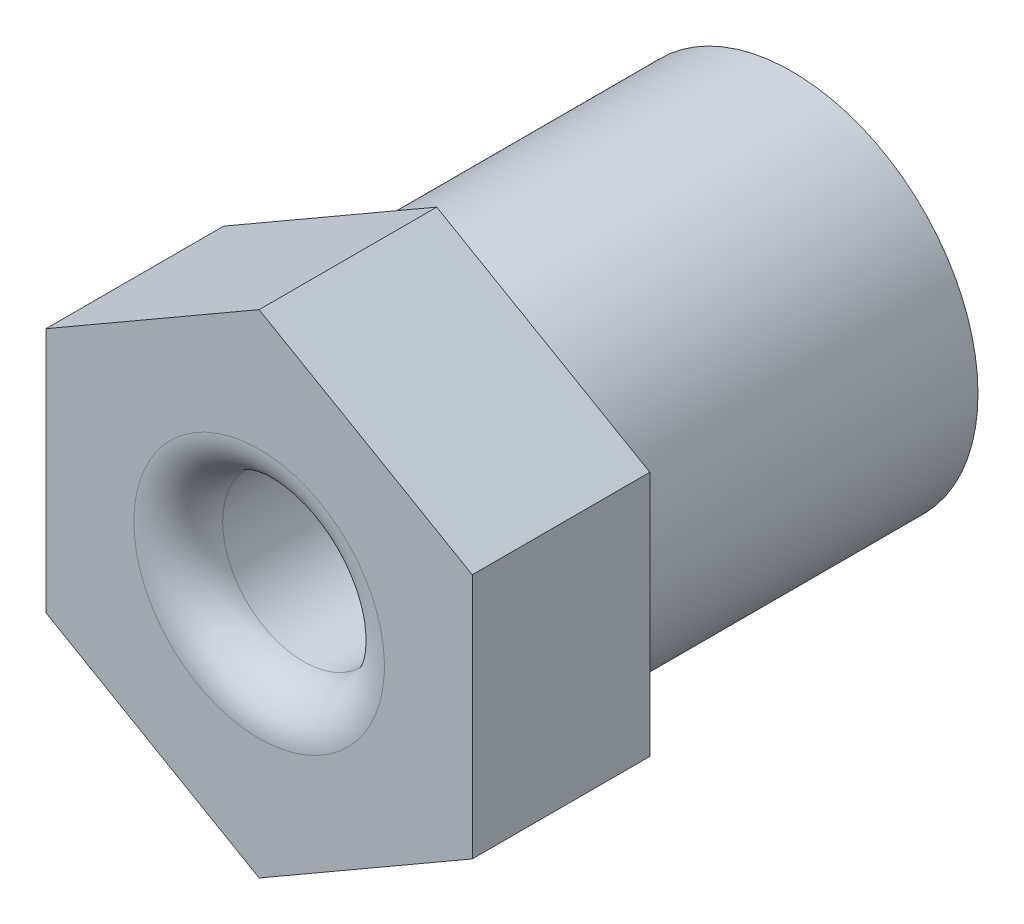
ISO-10303-21;
HEADER;
FILE_DESCRIPTION(('STEP AP214'),'2;1');
FILE_NAME('part.step','',(''),(''),'','','');
FILE_SCHEMA(('AUTOMOTIVE_DESIGN { 1 0 10303 214 1 1 1 1 }'));
ENDSEC;
DATA;
#1=APPLICATION_CONTEXT('core data for automotive mechanical design processes');
#2=APPLICATION_PROTOCOL_DEFINITION('international standard','automotive_design',2000,#1);
#3=PRODUCT_CONTEXT('',#1,'mechanical');
#4=PRODUCT('Part','Part','',(#3));
#5=PRODUCT_RELATED_PRODUCT_CATEGORY('part','',(#4));
#6=PRODUCT_DEFINITION_FORMATION('','',#4);
#7=PRODUCT_DEFINITION_CONTEXT('part definition',#1,'design');
#8=PRODUCT_DEFINITION('design','',#6,#7);
#9=PRODUCT_DEFINITION_SHAPE('','',#8);
#10=(LENGTH_UNIT() NAMED_UNIT(*) SI_UNIT(.MILLI.,.METRE.));
#11=(NAMED_UNIT(*) PLANE_ANGLE_UNIT() SI_UNIT($,.RADIAN.));
#12=(NAMED_UNIT(*) SI_UNIT($,.STERADIAN.) SOLID_ANGLE_UNIT());
#13=UNCERTAINTY_MEASURE_WITH_UNIT(LENGTH_MEASURE(1.E-05),#10,'distance_accuracy_value','');
#14=(GEOMETRIC_REPRESENTATION_CONTEXT(3) GLOBAL_UNCERTAINTY_ASSIGNED_CONTEXT((#13)) GLOBAL_UNIT_ASSIGNED_CONTEXT((#10,
#11,#12)) REPRESENTATION_CONTEXT('',''));
#15=CARTESIAN_POINT('',(0.,0.,0.));
#16=DIRECTION('',(0.,0.,1.));
#17=DIRECTION('',(1.,0.,0.));
#18=AXIS2_PLACEMENT_3D('',#15,#16,#17);
#19=CARTESIAN_POINT('',(-3.65791116486798,3.45094953686021,0.));
#20=DIRECTION('',(0.,0.,1.));
#21=DIRECTION('',(1.,0.,0.));
#22=AXIS2_PLACEMENT_3D('',#19,#20,#21);
#23=PLANE('',#22);
#24=CARTESIAN_POINT('',(-3.65791116486798,3.45094953686021,0.));
#25=DIRECTION('',(0.,0.,1.));
#26=DIRECTION('',(-1.,0.,0.));
#27=AXIS2_PLACEMENT_3D('',#24,#25,#26);
#28=CIRCLE('',#27,0.91087);
#29=CARTESIAN_POINT('',(-4.56878116486798,3.45094953686021,0.));
#30=VERTEX_POINT('',#29);
#31=EDGE_CURVE('E126',#30,#30,#28,.T.);
#32=ORIENTED_EDGE('',*,*,#31,.T.);
#33=EDGE_LOOP('',(#32));
#34=FACE_BOUND('',#33,.T.);
#35=CARTESIAN_POINT('',(-3.65791116486798,3.45094953686021,0.));
#36=DIRECTION('',(0.,0.,-1.));
#37=DIRECTION('',(1.,0.,0.));
#38=AXIS2_PLACEMENT_3D('',#35,#36,#37);
#39=CIRCLE('',#38,1.6);
#40=CARTESIAN_POINT('',(-2.05791116486798,3.45094953686021,0.));
#41=VERTEX_POINT('',#40);
#42=EDGE_CURVE('E166',#41,#41,#39,.T.);
#43=ORIENTED_EDGE('',*,*,#42,.T.);
#44=EDGE_LOOP('',(#43));
#45=FACE_BOUND('',#44,.T.);
#46=ADVANCED_FACE('F17',(#34,#45),#23,.F.);
#47=CARTESIAN_POINT('',(-1.25791116486653,4.83659053686006,0.));
#48=DIRECTION('',(1.,0.,0.));
#49=DIRECTION('',(0.,1.,0.));
#50=AXIS2_PLACEMENT_3D('',#47,#48,#49);
#51=PLANE('',#50);
#52=DIRECTION('',(0.,-1.,0.));
#53=VECTOR('',#52,1.);
#54=CARTESIAN_POINT('',(-1.25791116486653,4.83659053686006,2.));
#55=LINE('',#54,#53);
#56=CARTESIAN_POINT('',(-1.25791116486653,4.83659053686006,2.));
#57=VERTEX_POINT('',#56);
#58=CARTESIAN_POINT('',(-1.25791116486653,2.06530853686036,2.));
#59=VERTEX_POINT('',#58);
#60=EDGE_CURVE('E132',#57,#59,#55,.T.);
#61=ORIENTED_EDGE('',*,*,#60,.T.);
#62=DIRECTION('',(0.,0.,1.));
#63=VECTOR('',#62,1.);
#64=CARTESIAN_POINT('',(-1.25791116486653,2.06530853686036,0.));
#65=LINE('',#64,#63);
#66=CARTESIAN_POINT('',(-1.25791116486653,2.06530853686036,0.));
#67=VERTEX_POINT('',#66);
#68=EDGE_CURVE('E144',#67,#59,#65,.T.);
#69=ORIENTED_EDGE('',*,*,#68,.F.);
#70=DIRECTION('',(0.,-1.,0.));
#71=VECTOR('',#70,1.);
#72=CARTESIAN_POINT('',(-1.25791116486653,4.83659053686006,0.));
#73=LINE('',#72,#71);
#74=CARTESIAN_POINT('',(-1.25791116486653,4.83659053686006,0.));
#75=VERTEX_POINT('',#74);
#76=EDGE_CURVE('E175',#75,#67,#73,.T.);
#77=ORIENTED_EDGE('',*,*,#76,.F.);
#78=DIRECTION('',(0.,0.,1.));
#79=VECTOR('',#78,1.);
#80=CARTESIAN_POINT('',(-1.25791116486653,4.83659053686006,0.));
#81=LINE('',#80,#79);
#82=EDGE_CURVE('E11',#75,#57,#81,.T.);
#83=ORIENTED_EDGE('',*,*,#82,.T.);
#84=EDGE_LOOP('',(#61,#69,#77,#83));
#85=FACE_BOUND('',#84,.T.);
#86=ADVANCED_FACE('F211',(#85),#51,.T.);
#87=CARTESIAN_POINT('',(-3.65791116486798,6.22223053686048,0.));
#88=DIRECTION('',(0.499999825156066,0.866025504730608,0.));
#89=DIRECTION('',(0.,0.,-1.));
#90=AXIS2_PLACEMENT_3D('',#87,#88,#89);
#91=PLANE('',#90);
#92=DIRECTION('',(0.866025504730608,-0.499999825156065,0.));
#93=VECTOR('',#92,1.);
#94=CARTESIAN_POINT('',(-3.65791116486798,6.22223053686048,2.));
#95=LINE('',#94,#93);
#96=CARTESIAN_POINT('',(-3.65791116486798,6.22223053686048,2.));
#97=VERTEX_POINT('',#96);
#98=EDGE_CURVE('E136',#97,#57,#95,.T.);
#99=ORIENTED_EDGE('',*,*,#98,.T.);
#100=ORIENTED_EDGE('',*,*,#82,.F.);
#101=DIRECTION('',(0.866025504730608,-0.499999825156065,0.));
#102=VECTOR('',#101,1.);
#103=CARTESIAN_POINT('',(-3.65791116486798,6.22223053686048,0.));
#104=LINE('',#103,#102);
#105=CARTESIAN_POINT('',(-3.65791116486798,6.22223053686048,0.));
#106=VERTEX_POINT('',#105);
#107=EDGE_CURVE('E102',#106,#75,#104,.T.);
#108=ORIENTED_EDGE('',*,*,#107,.F.);
#109=DIRECTION('',(0.,0.,1.));
#110=VECTOR('',#109,1.);
#111=CARTESIAN_POINT('',(-3.65791116486798,6.22223053686048,0.));
#112=LINE('',#111,#110);
#113=EDGE_CURVE('E26',#106,#97,#112,.T.);
#114=ORIENTED_EDGE('',*,*,#113,.T.);
#115=EDGE_LOOP('',(#99,#100,#108,#114));
#116=FACE_BOUND('',#115,.T.);
#117=ADVANCED_FACE('F19',(#116),#91,.T.);
#118=CARTESIAN_POINT('',(-6.05791116486944,4.83659053686006,0.));
#119=DIRECTION('',(-0.499999825156066,0.866025504730608,0.));
#120=DIRECTION('',(0.,0.,1.));
#121=AXIS2_PLACEMENT_3D('',#118,#119,#120);
#122=PLANE('',#121);
#123=DIRECTION('',(0.866025504730608,0.499999825156065,0.));
#124=VECTOR('',#123,1.);
#125=CARTESIAN_POINT('',(-6.05791116486944,4.83659053686006,2.));
#126=LINE('',#125,#124);
#127=CARTESIAN_POINT('',(-6.05791116486944,4.83659053686006,2.));
#128=VERTEX_POINT('',#127);
#129=EDGE_CURVE('E137',#128,#97,#126,.T.);
#130=ORIENTED_EDGE('',*,*,#129,.T.);
#131=ORIENTED_EDGE('',*,*,#113,.F.);
#132=DIRECTION('',(0.866025504730608,0.499999825156065,0.));
#133=VECTOR('',#132,1.);
#134=CARTESIAN_POINT('',(-6.05791116486944,4.83659053686006,0.));
#135=LINE('',#134,#133);
#136=CARTESIAN_POINT('',(-6.05791116486944,4.83659053686006,0.));
#137=VERTEX_POINT('',#136);
#138=EDGE_CURVE('E96',#137,#106,#135,.T.);
#139=ORIENTED_EDGE('',*,*,#138,.F.);
#140=DIRECTION('',(0.,0.,1.));
#141=VECTOR('',#140,1.);
#142=CARTESIAN_POINT('',(-6.05791116486944,4.83659053686006,0.));
#143=LINE('',#142,#141);
#144=EDGE_CURVE('E48',#137,#128,#143,.T.);
#145=ORIENTED_EDGE('',*,*,#144,.T.);
#146=EDGE_LOOP('',(#130,#131,#139,#145));
#147=FACE_BOUND('',#146,.T.);
#148=ADVANCED_FACE('F97',(#147),#122,.T.);
#149=CARTESIAN_POINT('',(-6.05791116486944,2.06530853686036,0.));
#150=DIRECTION('',(-1.,0.,0.));
#151=DIRECTION('',(0.,0.,1.));
#152=AXIS2_PLACEMENT_3D('',#149,#150,#151);
#153=PLANE('',#152);
#154=DIRECTION('',(0.,1.,0.));
#155=VECTOR('',#154,1.);
#156=CARTESIAN_POINT('',(-6.05791116486944,2.06530853686036,2.));
#157=LINE('',#156,#155);
#158=CARTESIAN_POINT('',(-6.05791116486944,2.06530853686036,2.));
#159=VERTEX_POINT('',#158);
#160=EDGE_CURVE('E91',#159,#128,#157,.T.);
#161=ORIENTED_EDGE('',*,*,#160,.T.);
#162=ORIENTED_EDGE('',*,*,#144,.F.);
#163=DIRECTION('',(0.,1.,0.));
#164=VECTOR('',#163,1.);
#165=CARTESIAN_POINT('',(-6.05791116486944,2.06530853686036,0.));
#166=LINE('',#165,#164);
#167=CARTESIAN_POINT('',(-6.05791116486944,2.06530853686036,0.));
#168=VERTEX_POINT('',#167);
#169=EDGE_CURVE('E88',#168,#137,#166,.T.);
#170=ORIENTED_EDGE('',*,*,#169,.F.);
#171=DIRECTION('',(0.,0.,1.));
#172=VECTOR('',#171,1.);
#173=CARTESIAN_POINT('',(-6.05791116486944,2.06530853686036,0.));
#174=LINE('',#173,#172);
#175=EDGE_CURVE('E38',#168,#159,#174,.T.);
#176=ORIENTED_EDGE('',*,*,#175,.T.);
#177=EDGE_LOOP('',(#161,#162,#170,#176));
#178=FACE_BOUND('',#177,.T.);
#179=ADVANCED_FACE('F86',(#178),#153,.T.);
#180=CARTESIAN_POINT('',(-3.65791116486798,0.679668536859936,0.));
#181=DIRECTION('',(-0.499999825156065,-0.866025504730608,0.));
#182=DIRECTION('',(-0.866025504730608,0.499999825156065,0.));
#183=AXIS2_PLACEMENT_3D('',#180,#181,#182);
#184=PLANE('',#183);
#185=DIRECTION('',(-0.866025504730608,0.499999825156065,0.));
#186=VECTOR('',#185,1.);
#187=CARTESIAN_POINT('',(-3.65791116486798,0.679668536859936,2.));
#188=LINE('',#187,#186);
#189=CARTESIAN_POINT('',(-3.65791116486798,0.679668536859936,2.));
#190=VERTEX_POINT('',#189);
#191=EDGE_CURVE('E122',#190,#159,#188,.T.);
#192=ORIENTED_EDGE('',*,*,#191,.T.);
#193=ORIENTED_EDGE('',*,*,#175,.F.);
#194=DIRECTION('',(-0.866025504730608,0.499999825156065,0.));
#195=VECTOR('',#194,1.);
#196=CARTESIAN_POINT('',(-3.65791116486798,0.679668536859936,0.));
#197=LINE('',#196,#195);
#198=CARTESIAN_POINT('',(-3.65791116486798,0.679668536859936,0.));
#199=VERTEX_POINT('',#198);
#200=EDGE_CURVE('E108',#199,#168,#197,.T.);
#201=ORIENTED_EDGE('',*,*,#200,.F.);
#202=DIRECTION('',(0.,0.,1.));
#203=VECTOR('',#202,1.);
#204=CARTESIAN_POINT('',(-3.65791116486798,0.679668536859936,0.));
#205=LINE('',#204,#203);
#206=EDGE_CURVE('E125',#199,#190,#205,.T.);
#207=ORIENTED_EDGE('',*,*,#206,.T.);
#208=EDGE_LOOP('',(#192,#193,#201,#207));
#209=FACE_BOUND('',#208,.T.);
#210=ADVANCED_FACE('F199',(#209),#184,.T.);
#211=CARTESIAN_POINT('',(-1.25791116486653,2.06530853686036,0.));
#212=DIRECTION('',(0.499999825156065,-0.866025504730608,0.));
#213=DIRECTION('',(0.,0.,-1.));
#214=AXIS2_PLACEMENT_3D('',#211,#212,#213);
#215=PLANE('',#214);
#216=DIRECTION('',(-0.866025504730608,-0.499999825156065,0.));
#217=VECTOR('',#216,1.);
#218=CARTESIAN_POINT('',(-1.25791116486653,2.06530853686036,2.));
#219=LINE('',#218,#217);
#220=EDGE_CURVE('E130',#59,#190,#219,.T.);
#221=ORIENTED_EDGE('',*,*,#220,.T.);
#222=ORIENTED_EDGE('',*,*,#206,.F.);
#223=DIRECTION('',(-0.866025504730608,-0.499999825156065,0.));
#224=VECTOR('',#223,1.);
#225=CARTESIAN_POINT('',(-1.25791116486653,2.06530853686036,0.));
#226=LINE('',#225,#224);
#227=EDGE_CURVE('E115',#67,#199,#226,.T.);
#228=ORIENTED_EDGE('',*,*,#227,.F.);
#229=ORIENTED_EDGE('',*,*,#68,.T.);
#230=EDGE_LOOP('',(#221,#222,#228,#229));
#231=FACE_BOUND('',#230,.T.);
#232=ADVANCED_FACE('F196',(#231),#215,.T.);
#233=CARTESIAN_POINT('',(-3.65791116486798,3.45094953686021,2.));
#234=DIRECTION('',(0.,0.,1.));
#235=DIRECTION('',(1.,0.,0.));
#236=AXIS2_PLACEMENT_3D('',#233,#234,#235);
#237=PLANE('',#236);
#238=CARTESIAN_POINT('',(-3.65791116486798,3.45094953686021,2.));
#239=DIRECTION('',(0.,0.,1.));
#240=DIRECTION('',(-1.,0.,0.));
#241=AXIS2_PLACEMENT_3D('',#238,#239,#240);
#242=CIRCLE('',#241,1.41087);
#243=CARTESIAN_POINT('',(-5.06878116486799,3.45094953686021,2.));
#244=VERTEX_POINT('',#243);
#245=EDGE_CURVE('E131',#244,#244,#242,.T.);
#246=ORIENTED_EDGE('',*,*,#245,.F.);
#247=EDGE_LOOP('',(#246));
#248=FACE_BOUND('',#247,.T.);
#249=ORIENTED_EDGE('',*,*,#220,.F.);
#250=ORIENTED_EDGE('',*,*,#60,.F.);
#251=ORIENTED_EDGE('',*,*,#98,.F.);
#252=ORIENTED_EDGE('',*,*,#129,.F.);
#253=ORIENTED_EDGE('',*,*,#160,.F.);
#254=ORIENTED_EDGE('',*,*,#191,.F.);
#255=EDGE_LOOP('',(#249,#250,#251,#252,#253,#254));
#256=FACE_BOUND('',#255,.T.);
#257=ADVANCED_FACE('F157',(#248,#256),#237,.T.);
#258=CARTESIAN_POINT('',(-3.65791116486798,3.45094953686021,2.));
#259=DIRECTION('',(0.,0.,-1.));
#260=DIRECTION('',(-1.,0.,0.));
#261=AXIS2_PLACEMENT_3D('',#258,#259,#260);
#262=CYLINDRICAL_SURFACE('',#261,0.91087);
#263=CARTESIAN_POINT('',(-3.65791116486798,3.45094953686021,1.5));
#264=DIRECTION('',(0.,0.,-1.));
#265=DIRECTION('',(-1.,0.,0.));
#266=AXIS2_PLACEMENT_3D('',#263,#264,#265);
#267=CIRCLE('',#266,0.91087);
#268=CARTESIAN_POINT('',(-4.56878116486798,3.45094953686021,1.5));
#269=VERTEX_POINT('',#268);
#270=EDGE_CURVE('E120',#269,#269,#267,.T.);
#271=ORIENTED_EDGE('',*,*,#270,.F.);
#272=EDGE_LOOP('',(#271));
#273=FACE_BOUND('',#272,.T.);
#274=ORIENTED_EDGE('',*,*,#31,.F.);
#275=EDGE_LOOP('',(#274));
#276=FACE_BOUND('',#275,.T.);
#277=ADVANCED_FACE('F278',(#273,#276),#262,.F.);
#278=CARTESIAN_POINT('',(-3.65791116486798,3.45094953686021,1.5));
#279=DIRECTION('',(0.,0.,-1.));
#280=DIRECTION('',(-1.,0.,0.));
#281=AXIS2_PLACEMENT_3D('',#278,#279,#280);
#282=TOROIDAL_SURFACE('',#281,1.41087,0.5);
#283=ORIENTED_EDGE('',*,*,#245,.T.);
#284=EDGE_LOOP('',(#283));
#285=FACE_BOUND('',#284,.T.);
#286=ORIENTED_EDGE('',*,*,#270,.T.);
#287=EDGE_LOOP('',(#286));
#288=FACE_BOUND('',#287,.T.);
#289=ADVANCED_FACE('F233',(#285,#288),#282,.T.);
#290=CARTESIAN_POINT('',(-3.65791116486798,3.45094953686021,0.));
#291=DIRECTION('',(0.,0.,1.));
#292=DIRECTION('',(1.,0.,0.));
#293=AXIS2_PLACEMENT_3D('',#290,#291,#292);
#294=PLANE('',#293);
#295=CARTESIAN_POINT('',(-3.65791116486798,3.45094953686021,0.));
#296=DIRECTION('',(0.,0.,1.));
#297=DIRECTION('',(1.,0.,0.));
#298=AXIS2_PLACEMENT_3D('',#295,#296,#297);
#299=CIRCLE('',#298,2.095);
#300=CARTESIAN_POINT('',(-1.56291116486798,3.45094953686021,0.));
#301=VERTEX_POINT('',#300);
#302=EDGE_CURVE('E171',#301,#301,#299,.T.);
#303=ORIENTED_EDGE('',*,*,#302,.T.);
#304=EDGE_LOOP('',(#303));
#305=FACE_BOUND('',#304,.T.);
#306=ORIENTED_EDGE('',*,*,#76,.T.);
#307=ORIENTED_EDGE('',*,*,#227,.T.);
#308=ORIENTED_EDGE('',*,*,#200,.T.);
#309=ORIENTED_EDGE('',*,*,#169,.T.);
#310=ORIENTED_EDGE('',*,*,#138,.T.);
#311=ORIENTED_EDGE('',*,*,#107,.T.);
#312=EDGE_LOOP('',(#306,#307,#308,#309,#310,#311));
#313=FACE_BOUND('',#312,.T.);
#314=ADVANCED_FACE('F105',(#305,#313),#294,.F.);
#315=CARTESIAN_POINT('',(-3.65791116486798,3.45094953686021,-4.));
#316=DIRECTION('',(0.,0.,1.));
#317=DIRECTION('',(1.,0.,0.));
#318=AXIS2_PLACEMENT_3D('',#315,#316,#317);
#319=PLANE('',#318);
#320=CARTESIAN_POINT('',(-3.65791116486798,3.45094953686021,-4.));
#321=DIRECTION('',(0.,0.,1.));
#322=DIRECTION('',(1.,0.,0.));
#323=AXIS2_PLACEMENT_3D('',#320,#321,#322);
#324=CIRCLE('',#323,1.6);
#325=CARTESIAN_POINT('',(-2.05791116486798,3.45094953686021,-4.));
#326=VERTEX_POINT('',#325);
#327=EDGE_CURVE('E163',#326,#326,#324,.T.);
#328=ORIENTED_EDGE('',*,*,#327,.T.);
#329=EDGE_LOOP('',(#328));
#330=FACE_BOUND('',#329,.T.);
#331=CARTESIAN_POINT('',(-3.65791116486798,3.45094953686021,-4.));
#332=DIRECTION('',(0.,0.,1.));
#333=DIRECTION('',(1.,0.,0.));
#334=AXIS2_PLACEMENT_3D('',#331,#332,#333);
#335=CIRCLE('',#334,2.095);
#336=CARTESIAN_POINT('',(-1.56291116486798,3.45094953686021,-4.));
#337=VERTEX_POINT('',#336);
#338=EDGE_CURVE('E176',#337,#337,#335,.T.);
#339=ORIENTED_EDGE('',*,*,#338,.F.);
#340=EDGE_LOOP('',(#339));
#341=FACE_BOUND('',#340,.T.);
#342=ADVANCED_FACE('F224',(#330,#341),#319,.F.);
#343=CARTESIAN_POINT('',(-3.65791116486798,3.45094953686021,0.));
#344=DIRECTION('',(0.,0.,-1.));
#345=DIRECTION('',(1.,0.,0.));
#346=AXIS2_PLACEMENT_3D('',#343,#344,#345);
#347=CYLINDRICAL_SURFACE('',#346,2.095);
#348=ORIENTED_EDGE('',*,*,#302,.F.);
#349=EDGE_LOOP('',(#348));
#350=FACE_BOUND('',#349,.T.);
#351=ORIENTED_EDGE('',*,*,#338,.T.);
#352=EDGE_LOOP('',(#351));
#353=FACE_BOUND('',#352,.T.);
#354=ADVANCED_FACE('F222',(#350,#353),#347,.T.);
#355=CARTESIAN_POINT('',(-3.65791116486798,3.45094953686021,0.));
#356=DIRECTION('',(0.,0.,-1.));
#357=DIRECTION('',(1.,0.,0.));
#358=AXIS2_PLACEMENT_3D('',#355,#356,#357);
#359=CYLINDRICAL_SURFACE('',#358,1.6);
#360=ORIENTED_EDGE('',*,*,#42,.F.);
#361=EDGE_LOOP('',(#360));
#362=FACE_BOUND('',#361,.T.);
#363=ORIENTED_EDGE('',*,*,#327,.F.);
#364=EDGE_LOOP('',(#363));
#365=FACE_BOUND('',#364,.T.);
#366=ADVANCED_FACE('F231',(#362,#365),#359,.F.);
#367=CLOSED_SHELL('',(#46,#86,#117,#148,#179,#210,#232,#257,#277,#289,#314,#342,#354,#366));
#368=MANIFOLD_SOLID_BREP('B1',#367);
#369=ADVANCED_BREP_SHAPE_REPRESENTATION('',(#18,#368),#14);
#370=SHAPE_DEFINITION_REPRESENTATION(#9,#369);
ENDSEC;
END-ISO-10303-21;
